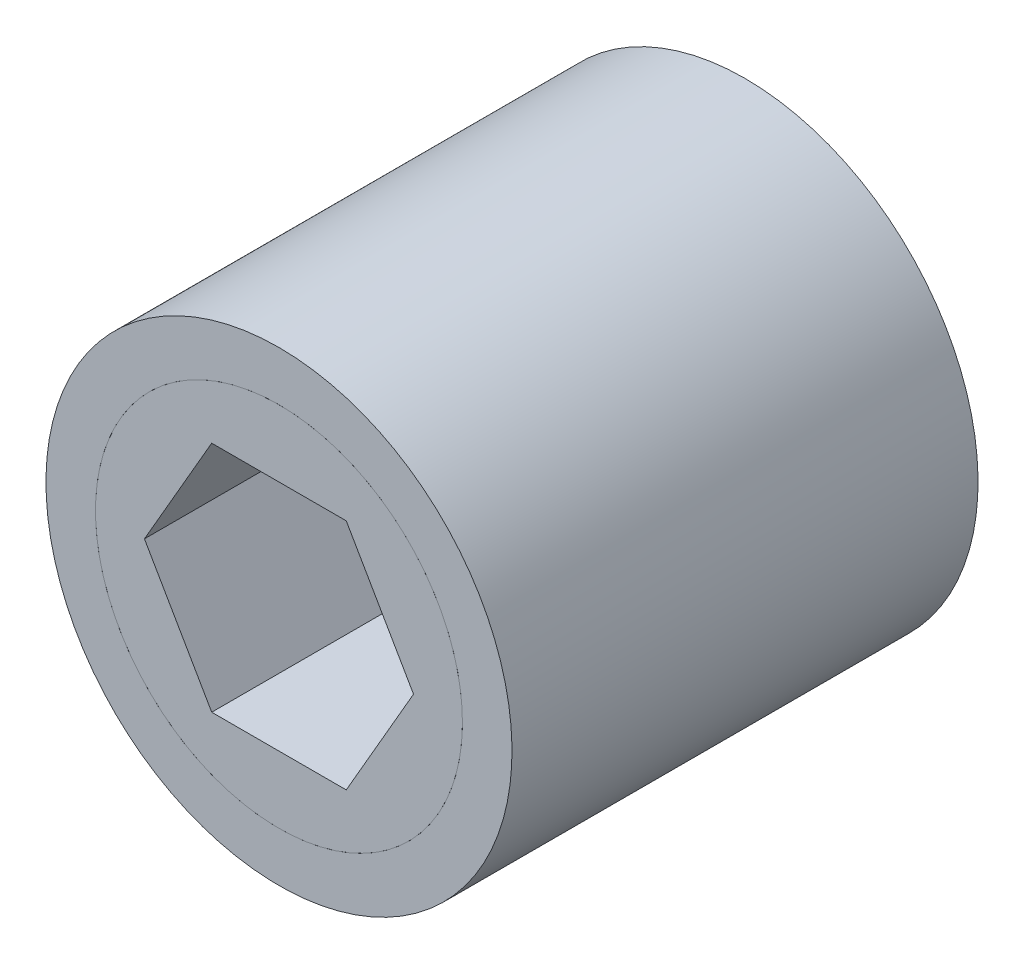
ISO-10303-21;
HEADER;
FILE_DESCRIPTION(('STEP AP214'),'2;1');
FILE_NAME('part.step','',(''),(''),'','','');
FILE_SCHEMA(('AUTOMOTIVE_DESIGN { 1 0 10303 214 1 1 1 1 }'));
ENDSEC;
DATA;
#1=APPLICATION_CONTEXT('core data for automotive mechanical design processes');
#2=APPLICATION_PROTOCOL_DEFINITION('international standard','automotive_design',2000,#1);
#3=PRODUCT_CONTEXT('',#1,'mechanical');
#4=PRODUCT('Part','Part','',(#3));
#5=PRODUCT_RELATED_PRODUCT_CATEGORY('part','',(#4));
#6=PRODUCT_DEFINITION_FORMATION('','',#4);
#7=PRODUCT_DEFINITION_CONTEXT('part definition',#1,'design');
#8=PRODUCT_DEFINITION('design','',#6,#7);
#9=PRODUCT_DEFINITION_SHAPE('','',#8);
#10=(LENGTH_UNIT() NAMED_UNIT(*) SI_UNIT(.MILLI.,.METRE.));
#11=(NAMED_UNIT(*) PLANE_ANGLE_UNIT() SI_UNIT($,.RADIAN.));
#12=(NAMED_UNIT(*) SI_UNIT($,.STERADIAN.) SOLID_ANGLE_UNIT());
#13=UNCERTAINTY_MEASURE_WITH_UNIT(LENGTH_MEASURE(1.E-05),#10,'distance_accuracy_value','');
#14=(GEOMETRIC_REPRESENTATION_CONTEXT(3) GLOBAL_UNCERTAINTY_ASSIGNED_CONTEXT((#13)) GLOBAL_UNIT_ASSIGNED_CONTEXT((#10,
#11,#12)) REPRESENTATION_CONTEXT('',''));
#15=CARTESIAN_POINT('',(0.,0.,0.));
#16=DIRECTION('',(0.,0.,1.));
#17=DIRECTION('',(1.,0.,0.));
#18=AXIS2_PLACEMENT_3D('',#15,#16,#17);
#19=CARTESIAN_POINT('',(-3.66617420935412,-6.35,25.4));
#20=DIRECTION('',(0.,1.,0.));
#21=DIRECTION('',(1.,0.,0.));
#22=AXIS2_PLACEMENT_3D('',#19,#20,#21);
#23=PLANE('',#22);
#24=DIRECTION('',(1.,0.,0.));
#25=VECTOR('',#24,1.);
#26=CARTESIAN_POINT('',(-3.66617420935412,-6.35,0.));
#27=LINE('',#26,#25);
#28=CARTESIAN_POINT('',(-3.66617420935412,-6.35,0.));
#29=VERTEX_POINT('',#28);
#30=CARTESIAN_POINT('',(3.66617420935412,-6.35,0.));
#31=VERTEX_POINT('',#30);
#32=EDGE_CURVE('P0_E152',#29,#31,#27,.T.);
#33=ORIENTED_EDGE('',*,*,#32,.F.);
#34=DIRECTION('',(0.,0.,-1.));
#35=VECTOR('',#34,1.);
#36=CARTESIAN_POINT('',(-3.66617420935412,-6.35,25.4));
#37=LINE('',#36,#35);
#38=CARTESIAN_POINT('',(-3.66617420935412,-6.35,25.4));
#39=VERTEX_POINT('',#38);
#40=EDGE_CURVE('P0_E11',#39,#29,#37,.T.);
#41=ORIENTED_EDGE('',*,*,#40,.F.);
#42=DIRECTION('',(1.,0.,0.));
#43=VECTOR('',#42,1.);
#44=CARTESIAN_POINT('',(-3.66617420935412,-6.35,25.4));
#45=LINE('',#44,#43);
#46=CARTESIAN_POINT('',(3.66617420935412,-6.35,25.4));
#47=VERTEX_POINT('',#46);
#48=EDGE_CURVE('P0_E142',#39,#47,#45,.T.);
#49=ORIENTED_EDGE('',*,*,#48,.T.);
#50=DIRECTION('',(0.,0.,-1.));
#51=VECTOR('',#50,1.);
#52=CARTESIAN_POINT('',(3.66617420935412,-6.35,25.4));
#53=LINE('',#52,#51);
#54=EDGE_CURVE('P0_E91',#47,#31,#53,.T.);
#55=ORIENTED_EDGE('',*,*,#54,.T.);
#56=EDGE_LOOP('',(#33,#41,#49,#55));
#57=FACE_BOUND('',#56,.T.);
#58=ADVANCED_FACE('P0_F17',(#57),#23,.T.);
#59=CARTESIAN_POINT('',(-7.33234841870825,0.,25.4));
#60=DIRECTION('',(0.866025403784439,0.5,0.));
#61=DIRECTION('',(0.,0.,-1.));
#62=AXIS2_PLACEMENT_3D('',#59,#60,#61);
#63=PLANE('',#62);
#64=DIRECTION('',(0.5,-0.866025403784439,0.));
#65=VECTOR('',#64,1.);
#66=CARTESIAN_POINT('',(-7.33234841870825,0.,0.));
#67=LINE('',#66,#65);
#68=CARTESIAN_POINT('',(-7.33234841870825,0.,0.));
#69=VERTEX_POINT('',#68);
#70=EDGE_CURVE('P0_E158',#69,#29,#67,.T.);
#71=ORIENTED_EDGE('',*,*,#70,.F.);
#72=DIRECTION('',(0.,0.,-1.));
#73=VECTOR('',#72,1.);
#74=CARTESIAN_POINT('',(-7.33234841870825,0.,25.4));
#75=LINE('',#74,#73);
#76=CARTESIAN_POINT('',(-7.33234841870825,0.,25.4));
#77=VERTEX_POINT('',#76);
#78=EDGE_CURVE('P0_E21',#77,#69,#75,.T.);
#79=ORIENTED_EDGE('',*,*,#78,.F.);
#80=DIRECTION('',(0.5,-0.866025403784439,0.));
#81=VECTOR('',#80,1.);
#82=CARTESIAN_POINT('',(-7.33234841870825,0.,25.4));
#83=LINE('',#82,#81);
#84=EDGE_CURVE('P0_E134',#77,#39,#83,.T.);
#85=ORIENTED_EDGE('',*,*,#84,.T.);
#86=ORIENTED_EDGE('',*,*,#40,.T.);
#87=EDGE_LOOP('',(#71,#79,#85,#86));
#88=FACE_BOUND('',#87,.T.);
#89=ADVANCED_FACE('P0_F19',(#88),#63,.T.);
#90=CARTESIAN_POINT('',(-3.66617420935412,6.35,25.4));
#91=DIRECTION('',(0.866025403784439,-0.5,0.));
#92=DIRECTION('',(0.,0.,-1.));
#93=AXIS2_PLACEMENT_3D('',#90,#91,#92);
#94=PLANE('',#93);
#95=DIRECTION('',(-0.5,-0.866025403784439,0.));
#96=VECTOR('',#95,1.);
#97=CARTESIAN_POINT('',(-3.66617420935412,6.35,0.));
#98=LINE('',#97,#96);
#99=CARTESIAN_POINT('',(-3.66617420935412,6.35,0.));
#100=VERTEX_POINT('',#99);
#101=EDGE_CURVE('P0_E125',#100,#69,#98,.T.);
#102=ORIENTED_EDGE('',*,*,#101,.F.);
#103=DIRECTION('',(0.,0.,-1.));
#104=VECTOR('',#103,1.);
#105=CARTESIAN_POINT('',(-3.66617420935412,6.35,25.4));
#106=LINE('',#105,#104);
#107=CARTESIAN_POINT('',(-3.66617420935412,6.35,25.4));
#108=VERTEX_POINT('',#107);
#109=EDGE_CURVE('P0_E116',#108,#100,#106,.T.);
#110=ORIENTED_EDGE('',*,*,#109,.F.);
#111=DIRECTION('',(-0.5,-0.866025403784439,0.));
#112=VECTOR('',#111,1.);
#113=CARTESIAN_POINT('',(-3.66617420935412,6.35,25.4));
#114=LINE('',#113,#112);
#115=EDGE_CURVE('P0_E118',#108,#77,#114,.T.);
#116=ORIENTED_EDGE('',*,*,#115,.T.);
#117=ORIENTED_EDGE('',*,*,#78,.T.);
#118=EDGE_LOOP('',(#102,#110,#116,#117));
#119=FACE_BOUND('',#118,.T.);
#120=ADVANCED_FACE('P0_F117',(#119),#94,.T.);
#121=CARTESIAN_POINT('',(3.66617420935412,6.35,25.4));
#122=DIRECTION('',(0.,-1.,0.));
#123=DIRECTION('',(0.,0.,-1.));
#124=AXIS2_PLACEMENT_3D('',#121,#122,#123);
#125=PLANE('',#124);
#126=DIRECTION('',(-1.,0.,0.));
#127=VECTOR('',#126,1.);
#128=CARTESIAN_POINT('',(3.66617420935412,6.35,0.));
#129=LINE('',#128,#127);
#130=CARTESIAN_POINT('',(3.66617420935412,6.35,0.));
#131=VERTEX_POINT('',#130);
#132=EDGE_CURVE('P0_E147',#131,#100,#129,.T.);
#133=ORIENTED_EDGE('',*,*,#132,.F.);
#134=DIRECTION('',(0.,0.,-1.));
#135=VECTOR('',#134,1.);
#136=CARTESIAN_POINT('',(3.66617420935412,6.35,25.4));
#137=LINE('',#136,#135);
#138=CARTESIAN_POINT('',(3.66617420935412,6.35,25.4));
#139=VERTEX_POINT('',#138);
#140=EDGE_CURVE('P0_E82',#139,#131,#137,.T.);
#141=ORIENTED_EDGE('',*,*,#140,.F.);
#142=DIRECTION('',(-1.,0.,0.));
#143=VECTOR('',#142,1.);
#144=CARTESIAN_POINT('',(3.66617420935412,6.35,25.4));
#145=LINE('',#144,#143);
#146=EDGE_CURVE('P0_E124',#139,#108,#145,.T.);
#147=ORIENTED_EDGE('',*,*,#146,.T.);
#148=ORIENTED_EDGE('',*,*,#109,.T.);
#149=EDGE_LOOP('',(#133,#141,#147,#148));
#150=FACE_BOUND('',#149,.T.);
#151=ADVANCED_FACE('P0_F130',(#150),#125,.T.);
#152=CARTESIAN_POINT('',(7.33234841870825,0.,25.4));
#153=DIRECTION('',(-0.866025403784439,-0.5,0.));
#154=DIRECTION('',(-0.5,0.866025403784439,0.));
#155=AXIS2_PLACEMENT_3D('',#152,#153,#154);
#156=PLANE('',#155);
#157=DIRECTION('',(-0.5,0.866025403784439,0.));
#158=VECTOR('',#157,1.);
#159=CARTESIAN_POINT('',(7.33234841870825,0.,0.));
#160=LINE('',#159,#158);
#161=CARTESIAN_POINT('',(7.33234841870825,0.,0.));
#162=VERTEX_POINT('',#161);
#163=EDGE_CURVE('P0_E148',#162,#131,#160,.T.);
#164=ORIENTED_EDGE('',*,*,#163,.F.);
#165=DIRECTION('',(0.,0.,-1.));
#166=VECTOR('',#165,1.);
#167=CARTESIAN_POINT('',(7.33234841870825,0.,25.4));
#168=LINE('',#167,#166);
#169=CARTESIAN_POINT('',(7.33234841870825,0.,25.4));
#170=VERTEX_POINT('',#169);
#171=EDGE_CURVE('P0_E71',#170,#162,#168,.T.);
#172=ORIENTED_EDGE('',*,*,#171,.F.);
#173=DIRECTION('',(-0.5,0.866025403784439,0.));
#174=VECTOR('',#173,1.);
#175=CARTESIAN_POINT('',(7.33234841870825,0.,25.4));
#176=LINE('',#175,#174);
#177=EDGE_CURVE('P0_E248',#170,#139,#176,.T.);
#178=ORIENTED_EDGE('',*,*,#177,.T.);
#179=ORIENTED_EDGE('',*,*,#140,.T.);
#180=EDGE_LOOP('',(#164,#172,#178,#179));
#181=FACE_BOUND('',#180,.T.);
#182=ADVANCED_FACE('P0_F292',(#181),#156,.T.);
#183=CARTESIAN_POINT('',(3.66617420935412,-6.35,25.4));
#184=DIRECTION('',(-0.866025403784439,0.5,0.));
#185=DIRECTION('',(0.,0.,1.));
#186=AXIS2_PLACEMENT_3D('',#183,#184,#185);
#187=PLANE('',#186);
#188=DIRECTION('',(0.5,0.866025403784439,0.));
#189=VECTOR('',#188,1.);
#190=CARTESIAN_POINT('',(3.66617420935412,-6.35,0.));
#191=LINE('',#190,#189);
#192=EDGE_CURVE('P0_E151',#31,#162,#191,.T.);
#193=ORIENTED_EDGE('',*,*,#192,.F.);
#194=ORIENTED_EDGE('',*,*,#54,.F.);
#195=DIRECTION('',(0.5,0.866025403784439,0.));
#196=VECTOR('',#195,1.);
#197=CARTESIAN_POINT('',(3.66617420935412,-6.35,25.4));
#198=LINE('',#197,#196);
#199=EDGE_CURVE('P0_E240',#47,#170,#198,.T.);
#200=ORIENTED_EDGE('',*,*,#199,.T.);
#201=ORIENTED_EDGE('',*,*,#171,.T.);
#202=EDGE_LOOP('',(#193,#194,#200,#201));
#203=FACE_BOUND('',#202,.T.);
#204=ADVANCED_FACE('P0_F274',(#203),#187,.T.);
#205=CARTESIAN_POINT('',(0.,0.,25.4));
#206=DIRECTION('',(0.,0.,-1.));
#207=DIRECTION('',(-1.,0.,0.));
#208=AXIS2_PLACEMENT_3D('',#205,#206,#207);
#209=CYLINDRICAL_SURFACE('',#208,10.);
#210=CARTESIAN_POINT('',(0.,0.,25.4));
#211=DIRECTION('',(0.,0.,1.));
#212=DIRECTION('',(1.,0.,0.));
#213=AXIS2_PLACEMENT_3D('',#210,#211,#212);
#214=CIRCLE('',#213,10.);
#215=CARTESIAN_POINT('',(10.,0.,25.4));
#216=VERTEX_POINT('',#215);
#217=EDGE_CURVE('P0_E254',#216,#216,#214,.T.);
#218=ORIENTED_EDGE('',*,*,#217,.F.);
#219=EDGE_LOOP('',(#218));
#220=FACE_BOUND('',#219,.T.);
#221=CARTESIAN_POINT('',(0.,0.,0.));
#222=DIRECTION('',(0.,0.,1.));
#223=DIRECTION('',(1.,0.,0.));
#224=AXIS2_PLACEMENT_3D('',#221,#222,#223);
#225=CIRCLE('',#224,10.);
#226=CARTESIAN_POINT('',(10.,0.,0.));
#227=VERTEX_POINT('',#226);
#228=EDGE_CURVE('P0_E129',#227,#227,#225,.T.);
#229=ORIENTED_EDGE('',*,*,#228,.T.);
#230=EDGE_LOOP('',(#229));
#231=FACE_BOUND('',#230,.T.);
#232=ADVANCED_FACE('P0_F271',(#220,#231),#209,.T.);
#233=CARTESIAN_POINT('',(0.,0.,0.));
#234=DIRECTION('',(0.,0.,1.));
#235=DIRECTION('',(1.,0.,0.));
#236=AXIS2_PLACEMENT_3D('',#233,#234,#235);
#237=PLANE('',#236);
#238=ORIENTED_EDGE('',*,*,#192,.T.);
#239=ORIENTED_EDGE('',*,*,#163,.T.);
#240=ORIENTED_EDGE('',*,*,#132,.T.);
#241=ORIENTED_EDGE('',*,*,#101,.T.);
#242=ORIENTED_EDGE('',*,*,#70,.T.);
#243=ORIENTED_EDGE('',*,*,#32,.T.);
#244=EDGE_LOOP('',(#238,#239,#240,#241,#242,#243));
#245=FACE_BOUND('',#244,.T.);
#246=ORIENTED_EDGE('',*,*,#228,.F.);
#247=EDGE_LOOP('',(#246));
#248=FACE_BOUND('',#247,.T.);
#249=ADVANCED_FACE('P0_F273',(#245,#248),#237,.F.);
#250=CARTESIAN_POINT('',(0.,0.,25.4));
#251=DIRECTION('',(0.,0.,1.));
#252=DIRECTION('',(1.,0.,0.));
#253=AXIS2_PLACEMENT_3D('',#250,#251,#252);
#254=PLANE('',#253);
#255=ORIENTED_EDGE('',*,*,#177,.F.);
#256=ORIENTED_EDGE('',*,*,#199,.F.);
#257=ORIENTED_EDGE('',*,*,#48,.F.);
#258=ORIENTED_EDGE('',*,*,#84,.F.);
#259=ORIENTED_EDGE('',*,*,#115,.F.);
#260=ORIENTED_EDGE('',*,*,#146,.F.);
#261=EDGE_LOOP('',(#255,#256,#257,#258,#259,#260));
#262=FACE_BOUND('',#261,.T.);
#263=ORIENTED_EDGE('',*,*,#217,.T.);
#264=EDGE_LOOP('',(#263));
#265=FACE_BOUND('',#264,.T.);
#266=ADVANCED_FACE('P0_F135',(#262,#265),#254,.T.);
#267=CLOSED_SHELL('',(#58,#89,#120,#151,#182,#204,#232,#249,#266));
#268=MANIFOLD_SOLID_BREP('P0_B1',#267);
#269=CARTESIAN_POINT('',(0.,0.,0.));
#270=DIRECTION('',(0.,0.,1.));
#271=DIRECTION('',(0.,-1.,0.));
#272=AXIS2_PLACEMENT_3D('',#269,#270,#271);
#273=CYLINDRICAL_SURFACE('',#272,10.);
#274=CARTESIAN_POINT('',(0.,0.,0.));
#275=DIRECTION('',(0.,0.,-1.));
#276=DIRECTION('',(0.,1.,0.));
#277=AXIS2_PLACEMENT_3D('',#274,#275,#276);
#278=CIRCLE('',#277,10.);
#279=CARTESIAN_POINT('',(0.,10.,0.));
#280=VERTEX_POINT('',#279);
#281=EDGE_CURVE('P1_E48',#280,#280,#278,.T.);
#282=ORIENTED_EDGE('',*,*,#281,.T.);
#283=EDGE_LOOP('',(#282));
#284=FACE_BOUND('',#283,.T.);
#285=CARTESIAN_POINT('',(0.,0.,25.4));
#286=DIRECTION('',(0.,0.,-1.));
#287=DIRECTION('',(0.,1.,0.));
#288=AXIS2_PLACEMENT_3D('',#285,#286,#287);
#289=CIRCLE('',#288,10.);
#290=CARTESIAN_POINT('',(0.,10.,25.4));
#291=VERTEX_POINT('',#290);
#292=EDGE_CURVE('P1_E11',#291,#291,#289,.T.);
#293=ORIENTED_EDGE('',*,*,#292,.F.);
#294=EDGE_LOOP('',(#293));
#295=FACE_BOUND('',#294,.T.);
#296=ADVANCED_FACE('P1_F17',(#284,#295),#273,.F.);
#297=CARTESIAN_POINT('',(0.,0.,0.));
#298=DIRECTION('',(0.,0.,1.));
#299=DIRECTION('',(0.,-1.,0.));
#300=AXIS2_PLACEMENT_3D('',#297,#298,#299);
#301=CYLINDRICAL_SURFACE('',#300,12.7);
#302=CARTESIAN_POINT('',(0.,0.,0.));
#303=DIRECTION('',(0.,0.,-1.));
#304=DIRECTION('',(0.,1.,0.));
#305=AXIS2_PLACEMENT_3D('',#302,#303,#304);
#306=CIRCLE('',#305,12.7);
#307=CARTESIAN_POINT('',(0.,12.7,0.));
#308=VERTEX_POINT('',#307);
#309=EDGE_CURVE('P1_E55',#308,#308,#306,.T.);
#310=ORIENTED_EDGE('',*,*,#309,.F.);
#311=EDGE_LOOP('',(#310));
#312=FACE_BOUND('',#311,.T.);
#313=CARTESIAN_POINT('',(0.,0.,25.4));
#314=DIRECTION('',(0.,0.,-1.));
#315=DIRECTION('',(0.,1.,0.));
#316=AXIS2_PLACEMENT_3D('',#313,#314,#315);
#317=CIRCLE('',#316,12.7);
#318=CARTESIAN_POINT('',(0.,12.7,25.4));
#319=VERTEX_POINT('',#318);
#320=EDGE_CURVE('P1_E27',#319,#319,#317,.T.);
#321=ORIENTED_EDGE('',*,*,#320,.T.);
#322=EDGE_LOOP('',(#321));
#323=FACE_BOUND('',#322,.T.);
#324=ADVANCED_FACE('P1_F67',(#312,#323),#301,.T.);
#325=CARTESIAN_POINT('',(0.,0.,25.4));
#326=DIRECTION('',(0.,0.,-1.));
#327=DIRECTION('',(0.,-1.,0.));
#328=AXIS2_PLACEMENT_3D('',#325,#326,#327);
#329=PLANE('',#328);
#330=ORIENTED_EDGE('',*,*,#292,.T.);
#331=EDGE_LOOP('',(#330));
#332=FACE_BOUND('',#331,.T.);
#333=ORIENTED_EDGE('',*,*,#320,.F.);
#334=EDGE_LOOP('',(#333));
#335=FACE_BOUND('',#334,.T.);
#336=ADVANCED_FACE('P1_F66',(#332,#335),#329,.F.);
#337=CARTESIAN_POINT('',(0.,0.,0.));
#338=DIRECTION('',(0.,0.,-1.));
#339=DIRECTION('',(0.,-1.,0.));
#340=AXIS2_PLACEMENT_3D('',#337,#338,#339);
#341=PLANE('',#340);
#342=ORIENTED_EDGE('',*,*,#281,.F.);
#343=EDGE_LOOP('',(#342));
#344=FACE_BOUND('',#343,.T.);
#345=ORIENTED_EDGE('',*,*,#309,.T.);
#346=EDGE_LOOP('',(#345));
#347=FACE_BOUND('',#346,.T.);
#348=ADVANCED_FACE('P1_F63',(#344,#347),#341,.T.);
#349=CLOSED_SHELL('',(#296,#324,#336,#348));
#350=MANIFOLD_SOLID_BREP('P1_B1',#349);
#351=ADVANCED_BREP_SHAPE_REPRESENTATION('',(#18,#268,#350),#14);
#352=SHAPE_DEFINITION_REPRESENTATION(#9,#351);
ENDSEC;
END-ISO-10303-21;
